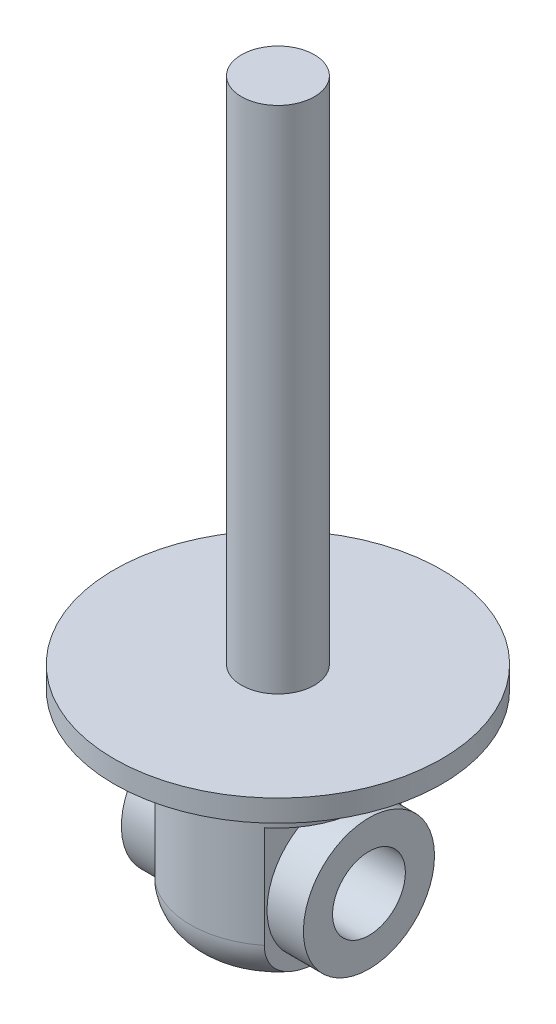
ISO-10303-21;
HEADER;
FILE_DESCRIPTION(('STEP AP214'),'2;1');
FILE_NAME('part.step','',(''),(''),'','','');
FILE_SCHEMA(('AUTOMOTIVE_DESIGN { 1 0 10303 214 1 1 1 1 }'));
ENDSEC;
DATA;
#1=APPLICATION_CONTEXT('core data for automotive mechanical design processes');
#2=APPLICATION_PROTOCOL_DEFINITION('international standard','automotive_design',2000,#1);
#3=PRODUCT_CONTEXT('',#1,'mechanical');
#4=PRODUCT('Part','Part','',(#3));
#5=PRODUCT_RELATED_PRODUCT_CATEGORY('part','',(#4));
#6=PRODUCT_DEFINITION_FORMATION('','',#4);
#7=PRODUCT_DEFINITION_CONTEXT('part definition',#1,'design');
#8=PRODUCT_DEFINITION('design','',#6,#7);
#9=PRODUCT_DEFINITION_SHAPE('','',#8);
#10=(LENGTH_UNIT() NAMED_UNIT(*) SI_UNIT(.MILLI.,.METRE.));
#11=(NAMED_UNIT(*) PLANE_ANGLE_UNIT() SI_UNIT($,.RADIAN.));
#12=(NAMED_UNIT(*) SI_UNIT($,.STERADIAN.) SOLID_ANGLE_UNIT());
#13=UNCERTAINTY_MEASURE_WITH_UNIT(LENGTH_MEASURE(1.E-05),#10,'distance_accuracy_value','');
#14=(GEOMETRIC_REPRESENTATION_CONTEXT(3) GLOBAL_UNCERTAINTY_ASSIGNED_CONTEXT((#13)) GLOBAL_UNIT_ASSIGNED_CONTEXT((#10,
#11,#12)) REPRESENTATION_CONTEXT('',''));
#15=CARTESIAN_POINT('',(0.,0.,0.));
#16=DIRECTION('',(0.,0.,1.));
#17=DIRECTION('',(1.,0.,0.));
#18=AXIS2_PLACEMENT_3D('',#15,#16,#17);
#19=CARTESIAN_POINT('',(-7.5,-8.,-14.));
#20=DIRECTION('',(1.,0.,0.));
#21=DIRECTION('',(0.,1.,0.));
#22=AXIS2_PLACEMENT_3D('',#19,#20,#21);
#23=PLANE('',#22);
#24=CARTESIAN_POINT('',(-7.5,-27.8094750193111,0.));
#25=CARTESIAN_POINT('',(-7.5,-27.8094752958151,0.184521628242419));
#26=CARTESIAN_POINT('',(-7.5,-27.8077270322999,0.369043480287191));
#27=CARTESIAN_POINT('',(-7.5,-27.8006130628877,0.737999394292284));
#28=CARTESIAN_POINT('',(-7.5,-27.7952477367066,0.922433463434384));
#29=CARTESIAN_POINT('',(-7.5,-27.780538513706,1.29122559425462));
#30=CARTESIAN_POINT('',(-7.5,-27.7711929215574,1.47558358999919));
#31=CARTESIAN_POINT('',(-7.5,-27.7479507640883,1.84401846668315));
#32=CARTESIAN_POINT('',(-7.5,-27.734054140347,2.02809534398339));
#33=CARTESIAN_POINT('',(-7.5,-27.701027325669,2.39498843631837));
#34=CARTESIAN_POINT('',(-7.5,-27.6819201299087,2.57780665418326));
#35=CARTESIAN_POINT('',(-7.5,-27.6375682217561,2.94269408038083));
#36=CARTESIAN_POINT('',(-7.5,-27.6123230495969,3.12476323156505));
#37=CARTESIAN_POINT('',(-7.5,-27.5259360262262,3.6691632505479));
#38=CARTESIAN_POINT('',(-7.5,-27.4541196223952,4.02997739530099));
#39=CARTESIAN_POINT('',(-7.5,-27.315114172541,4.57935988961709));
#40=CARTESIAN_POINT('',(-7.5,-27.2608348848703,4.77122256452969));
#41=CARTESIAN_POINT('',(-7.5,-27.1402411036094,5.15109529504942));
#42=CARTESIAN_POINT('',(-7.5,-27.0739312594077,5.33910680786539));
#43=CARTESIAN_POINT('',(-7.5,-26.928148698992,5.70992505463463));
#44=CARTESIAN_POINT('',(-7.5,-26.8486797977089,5.8927332791208));
#45=CARTESIAN_POINT('',(-7.5,-26.6756224712841,6.25155879665883));
#46=CARTESIAN_POINT('',(-7.5,-26.5820364486502,6.42757723883459));
#47=CARTESIAN_POINT('',(-7.5,-26.3958384208508,6.74413785402998));
#48=CARTESIAN_POINT('',(-7.5,-26.3053527427416,6.8859302136676));
#49=CARTESIAN_POINT('',(-7.5,-26.1136422044668,7.16205254122039));
#50=CARTESIAN_POINT('',(-7.5,-26.0124194056704,7.29638393401336));
#51=CARTESIAN_POINT('',(-7.5,-25.7991822855038,7.55627452274061));
#52=CARTESIAN_POINT('',(-7.5,-25.6871652583255,7.6818315054992));
#53=CARTESIAN_POINT('',(-7.5,-25.4525813942248,7.92270374400352));
#54=CARTESIAN_POINT('',(-7.5,-25.3300144777409,8.03801892249803));
#55=CARTESIAN_POINT('',(-7.5,-25.0736714823962,8.25792234562975));
#56=CARTESIAN_POINT('',(-7.5,-24.9398051473305,8.36240569865935));
#57=CARTESIAN_POINT('',(-7.5,-24.662616920615,8.55796576900282));
#58=CARTESIAN_POINT('',(-7.5,-24.5192963548439,8.64904436046083));
#59=CARTESIAN_POINT('',(-7.5,-24.2243409104845,8.81636481076627));
#60=CARTESIAN_POINT('',(-7.5,-24.0727112205185,8.89261579636783));
#61=CARTESIAN_POINT('',(-7.5,-23.7624095052739,9.02909243430965));
#62=CARTESIAN_POINT('',(-7.5,-23.6037388369551,9.08932115899453));
#63=CARTESIAN_POINT('',(-7.5,-23.3052245459151,9.1849514334904));
#64=CARTESIAN_POINT('',(-7.5,-23.1661361294911,9.22272405795733));
#65=CARTESIAN_POINT('',(-7.5,-22.8851087613884,9.28547940350164));
#66=CARTESIAN_POINT('',(-7.5,-22.7431701638949,9.31046370365637));
#67=CARTESIAN_POINT('',(-7.5,-22.4576599589478,9.34730641699016));
#68=CARTESIAN_POINT('',(-7.5,-22.3140890586128,9.35917031033292));
#69=CARTESIAN_POINT('',(-7.5,-22.0264648581988,9.36963164548865));
#70=CARTESIAN_POINT('',(-7.5,-21.8824115750842,9.36822954903948));
#71=CARTESIAN_POINT('',(-7.5,-21.6061914815275,9.35280339576898));
#72=CARTESIAN_POINT('',(-7.5,-21.4739684759154,9.33976569953801));
#73=CARTESIAN_POINT('',(-7.5,-21.2110534946456,9.3025636387872));
#74=CARTESIAN_POINT('',(-7.5,-21.0803620180608,9.27839574533066));
#75=CARTESIAN_POINT('',(-7.5,-20.8215410609612,9.21922065645586));
#76=CARTESIAN_POINT('',(-7.5,-20.6934101253726,9.18421981495561));
#77=CARTESIAN_POINT('',(-7.5,-20.4404340442512,9.1037455253616));
#78=CARTESIAN_POINT('',(-7.5,-20.3155901493276,9.05826815366643));
#79=CARTESIAN_POINT('',(-7.5,-20.0692031015505,8.95699564520569));
#80=CARTESIAN_POINT('',(-7.5,-19.9476868658852,8.90113499399756));
#81=CARTESIAN_POINT('',(-7.5,-19.7094920695403,8.77987692751897));
#82=CARTESIAN_POINT('',(-7.5,-19.5928152563103,8.71447610526943));
#83=CARTESIAN_POINT('',(-7.5,-19.2509911073174,8.50489875856372));
#84=CARTESIAN_POINT('',(-7.5,-19.0339195251877,8.34729299116935));
#85=CARTESIAN_POINT('',(-7.5,-18.609337427954,7.98870608163153));
#86=CARTESIAN_POINT('',(-7.5,-18.4039002281567,7.78529755950602));
#87=CARTESIAN_POINT('',(-7.5,-18.0246758733926,7.35109040646743));
#88=CARTESIAN_POINT('',(-7.5,-17.8508837047537,7.12029612399675));
#89=CARTESIAN_POINT('',(-7.5,-17.5744409595824,6.69864287979116));
#90=CARTESIAN_POINT('',(-7.5,-17.4648689537028,6.51223410047274));
#91=CARTESIAN_POINT('',(-7.5,-17.2626904112623,6.13034538679087));
#92=CARTESIAN_POINT('',(-7.5,-17.1700919878543,5.93486117014359));
#93=CARTESIAN_POINT('',(-7.5,-17.0006313082269,5.53658641063458));
#94=CARTESIAN_POINT('',(-7.5,-16.9238147555949,5.33377659321381));
#95=CARTESIAN_POINT('',(-7.5,-16.784875362625,4.92331428460811));
#96=CARTESIAN_POINT('',(-7.5,-16.7227484430634,4.71566315546475));
#97=CARTESIAN_POINT('',(-7.5,-16.5386673542946,4.02250667384637));
#98=CARTESIAN_POINT('',(-7.5,-16.4449803111871,3.52942656369883));
#99=CARTESIAN_POINT('',(-7.5,-16.3412352530644,2.78498720051468));
#100=CARTESIAN_POINT('',(-7.5,-16.3127705467372,2.53568557770051));
#101=CARTESIAN_POINT('',(-7.5,-16.2658269581612,2.03612434937441));
#102=CARTESIAN_POINT('',(-7.5,-16.2473468655649,1.78586486368144));
#103=CARTESIAN_POINT('',(-7.5,-16.2184283009414,1.28363112408655));
#104=CARTESIAN_POINT('',(-7.5,-16.208031590786,1.03165466176094));
#105=CARTESIAN_POINT('',(-7.5,-16.1941849220444,0.527501194688708));
#106=CARTESIAN_POINT('',(-7.5,-16.1907352988047,0.27532418084894));
#107=CARTESIAN_POINT('',(-7.5,-16.1903333462322,-0.228731345602946));
#108=CARTESIAN_POINT('',(-7.5,-16.193373232494,-0.480609853630143));
#109=CARTESIAN_POINT('',(-7.5,-16.2063332691715,-0.984173581494233));
#110=CARTESIAN_POINT('',(-7.5,-16.2162528039696,-1.2358588166087));
#111=CARTESIAN_POINT('',(-7.5,-16.2454935008677,-1.7627882566893));
#112=CARTESIAN_POINT('',(-7.5,-16.2656211327378,-2.03798990109168));
#113=CARTESIAN_POINT('',(-7.5,-16.3180418431017,-2.58731345976836));
#114=CARTESIAN_POINT('',(-7.5,-16.3503365349836,-2.86143522597441));
#115=CARTESIAN_POINT('',(-7.5,-16.4300545548583,-3.40623279358435));
#116=CARTESIAN_POINT('',(-7.5,-16.4774071358833,-3.67691867401872));
#117=CARTESIAN_POINT('',(-7.5,-16.5907053400646,-4.2143947607995));
#118=CARTESIAN_POINT('',(-7.5,-16.6566449229111,-4.4811862031647));
#119=CARTESIAN_POINT('',(-7.5,-16.7911834026755,-4.94217748017442));
#120=CARTESIAN_POINT('',(-7.5,-16.8549558474619,-5.13778160857807));
#121=CARTESIAN_POINT('',(-7.5,-16.9961265709521,-5.52399422741739));
#122=CARTESIAN_POINT('',(-7.5,-17.0735207892669,-5.71460418712136));
#123=CARTESIAN_POINT('',(-7.5,-17.2430793617625,-6.08921987221889));
#124=CARTESIAN_POINT('',(-7.5,-17.3352463319138,-6.27322442084438));
#125=CARTESIAN_POINT('',(-7.5,-17.5351759469553,-6.63256976145457));
#126=CARTESIAN_POINT('',(-7.5,-17.6429345063483,-6.80791280693597));
#127=CARTESIAN_POINT('',(-7.5,-17.8487615005736,-7.10989658300673));
#128=CARTESIAN_POINT('',(-7.5,-17.9436617626469,-7.23870103997639));
#129=CARTESIAN_POINT('',(-7.5,-18.143229826346,-7.48856622066219));
#130=CARTESIAN_POINT('',(-7.5,-18.2478987883735,-7.60962602152204));
#131=CARTESIAN_POINT('',(-7.5,-18.4668045949393,-7.84271387792474));
#132=CARTESIAN_POINT('',(-7.5,-18.5810384459287,-7.95474473789612));
#133=CARTESIAN_POINT('',(-7.5,-18.8187268203134,-8.16854933672494));
#134=CARTESIAN_POINT('',(-7.5,-18.9421800591116,-8.27032449994957));
#135=CARTESIAN_POINT('',(-7.5,-19.1987356397018,-8.46313596223061));
#136=CARTESIAN_POINT('',(-7.5,-19.3319055781875,-8.55408255407203));
#137=CARTESIAN_POINT('',(-7.5,-19.6061418402457,-8.72304401015934));
#138=CARTESIAN_POINT('',(-7.5,-19.747204378254,-8.80106500403696));
#139=CARTESIAN_POINT('',(-7.5,-20.0362068877473,-8.94309470867639));
#140=CARTESIAN_POINT('',(-7.5,-20.1841460034049,-9.00710515749598));
#141=CARTESIAN_POINT('',(-7.5,-20.4856380297523,-9.12014361193693));
#142=CARTESIAN_POINT('',(-7.5,-20.6391901444676,-9.16917373274798));
#143=CARTESIAN_POINT('',(-7.5,-20.9313639562727,-9.24643392787081));
#144=CARTESIAN_POINT('',(-7.5,-21.0695088202567,-9.27647685632879));
#145=CARTESIAN_POINT('',(-7.5,-21.3479315795213,-9.32406143536891));
#146=CARTESIAN_POINT('',(-7.5,-21.4882092809526,-9.34160421520928));
#147=CARTESIAN_POINT('',(-7.5,-21.769719609589,-9.36396002322678));
#148=CARTESIAN_POINT('',(-7.5,-21.9109518422674,-9.36877802253041));
#149=CARTESIAN_POINT('',(-7.5,-22.1932734390957,-9.36563613906261));
#150=CARTESIAN_POINT('',(-7.5,-22.3343628067459,-9.35767657732182));
#151=CARTESIAN_POINT('',(-7.5,-22.6064011749062,-9.32998563551062));
#152=CARTESIAN_POINT('',(-7.5,-22.7374295539783,-9.31102660205279));
#153=CARTESIAN_POINT('',(-7.5,-22.9974780227225,-9.26218788836622));
#154=CARTESIAN_POINT('',(-7.5,-23.1264974548056,-9.23230470755187));
#155=CARTESIAN_POINT('',(-7.5,-23.3815508516768,-9.16196479385525));
#156=CARTESIAN_POINT('',(-7.5,-23.5075862018083,-9.12151307666088));
#157=CARTESIAN_POINT('',(-7.5,-23.7559772755244,-9.03044888037393));
#158=CARTESIAN_POINT('',(-7.5,-23.8783315975104,-8.97983258590814));
#159=CARTESIAN_POINT('',(-7.5,-24.1205569584555,-8.8680617574251));
#160=CARTESIAN_POINT('',(-7.5,-24.2403549182387,-8.80674877020291));
#161=CARTESIAN_POINT('',(-7.5,-24.4747211723639,-8.67480187441993));
#162=CARTESIAN_POINT('',(-7.5,-24.5892875713423,-8.60416462323317));
#163=CARTESIAN_POINT('',(-7.5,-24.9242270275788,-8.37928997825773));
#164=CARTESIAN_POINT('',(-7.5,-25.13600210755,-8.21201407264852));
#165=CARTESIAN_POINT('',(-7.5,-25.5504485361803,-7.832942739178));
#166=CARTESIAN_POINT('',(-7.5,-25.7507010772538,-7.618532285847));
#167=CARTESIAN_POINT('',(-7.5,-26.1185076671662,-7.16337882817298));
#168=CARTESIAN_POINT('',(-7.5,-26.2860513710234,-6.9226275303298));
#169=CARTESIAN_POINT('',(-7.5,-26.5545024709803,-6.4788664395953));
#170=CARTESIAN_POINT('',(-7.5,-26.6619013252763,-6.279707295078));
#171=CARTESIAN_POINT('',(-7.5,-26.858559219587,-5.87254463104013));
#172=CARTESIAN_POINT('',(-7.5,-26.9478095430477,-5.66453691936401));
#173=CARTESIAN_POINT('',(-7.5,-27.1096214973705,-5.24180758530233));
#174=CARTESIAN_POINT('',(-7.5,-27.1821555960046,-5.02707553901332));
#175=CARTESIAN_POINT('',(-7.5,-27.3121001369762,-4.59305326757356));
#176=CARTESIAN_POINT('',(-7.5,-27.3695048137837,-4.37376133898657));
#177=CARTESIAN_POINT('',(-7.5,-27.4981886749365,-3.81417726059937));
#178=CARTESIAN_POINT('',(-7.5,-27.5604951716191,-3.4718329690517));
#179=CARTESIAN_POINT('',(-7.5,-27.6609019684328,-2.7835920061487));
#180=CARTESIAN_POINT('',(-7.5,-27.6989863972919,-2.43769315620305));
#181=CARTESIAN_POINT('',(-7.5,-27.7425563308733,-1.91723181279188));
#182=CARTESIAN_POINT('',(-7.5,-27.7548291128016,-1.74318957751326));
#183=CARTESIAN_POINT('',(-7.5,-27.7753986995787,-1.39487161182967));
#184=CARTESIAN_POINT('',(-7.5,-27.7836956019396,-1.22059588725638));
#185=CARTESIAN_POINT('',(-7.5,-27.796777523185,-0.87196539298604));
#186=CARTESIAN_POINT('',(-7.5,-27.8015635129394,-0.697610658492171));
#187=CARTESIAN_POINT('',(-7.5,-27.8079121855994,-0.348837350643893));
#188=CARTESIAN_POINT('',(-7.5,-27.8094747579462,-0.174418775305038));
#189=CARTESIAN_POINT('',(-7.5,-27.8094750193111,0.));
#190=B_SPLINE_CURVE_WITH_KNOTS('',3,(#24,#25,#26,#27,#28,#29,#30,#31,#32,#33,#34,#35,#36,#37,
#38,#39,#40,#41,#42,#43,#44,#45,#46,#47,#48,#49,#50,#51,#52,#53,#54,#55,#56,#57,#58,#59,#60,#61,
#62,#63,#64,#65,#66,#67,#68,#69,#70,#71,#72,#73,#74,#75,#76,#77,#78,#79,#80,#81,#82,#83,#84,#85,
#86,#87,#88,#89,#90,#91,#92,#93,#94,#95,#96,#97,#98,#99,#100,#101,#102,#103,#104,#105,#106,#107,
#108,#109,#110,#111,#112,#113,#114,#115,#116,#117,#118,#119,#120,#121,#122,#123,#124,#125,#126,
#127,#128,#129,#130,#131,#132,#133,#134,#135,#136,#137,#138,#139,#140,#141,#142,#143,#144,#145,
#146,#147,#148,#149,#150,#151,#152,#153,#154,#155,#156,#157,#158,#159,#160,#161,#162,#163,#164,
#165,#166,#167,#168,#169,#170,#171,#172,#173,#174,#175,#176,#177,#178,#179,#180,#181,#182,#183,
#184,#185,#186,#187,#188,#189),.UNSPECIFIED.,.T.,.F.,(4,2,2,2,2,2,2,2,2,2,2,2,2,2,2,2,2,2,2,2,2,
2,2,2,2,2,2,2,2,2,2,2,2,2,2,2,2,2,2,2,2,2,2,2,2,2,2,2,2,2,2,2,2,2,2,2,2,2,2,2,2,2,2,2,2,2,2,2,2,
2,2,2,2,2,2,2,2,2,2,2,2,2,4),(0.,0.553556541747907,1.10705498067111,1.6607894093517,
2.21453094651203,2.76586720349669,3.31724477121585,4.41912680182766,5.01698525599297,
5.61461314908642,6.21206808675634,6.80942146164093,7.31357153503217,7.81762499361292,
8.32180513447661,8.82598907791493,9.33467160980088,9.84328295415676,10.3515802378956,
10.8597799828438,11.291588037567,11.7233427606026,12.1549170790764,12.5864763761706,
12.9845986570771,13.3828472534997,13.7808627038906,14.1790274594521,14.579795450788,
14.9807069160888,15.7821103743006,16.6461503316802,17.5100532757815,18.1578732554314,
18.8060020817716,19.4559821948788,20.1057815998326,21.6069748462105,22.3596793389022,
23.1122925673175,23.8687687149109,24.6252813779039,25.3808870860738,26.1364251884592,
26.9640249034877,27.7917343993232,28.6156111127982,29.4392203950451,30.0559954213971,
30.6725869093732,31.2892877047367,31.9058271963482,32.3853559200308,32.8649416785199,
33.3443778968313,33.823747436381,34.3068464150843,34.7897156366604,35.2725249226045,
35.7552660053908,36.1788379642465,36.6023716529343,37.0257398573389,37.4490974249689,
37.8458122806135,38.2426543730445,38.639308470493,39.0361117351622,39.4393886143668,
39.8428104576492,40.6491243408277,41.5260051520067,42.403162850804,43.0810551134699,
43.7592721958252,44.4385984678267,45.1181832448308,46.1608437011148,47.2041866484774,
47.7275747628343,48.2509500399341,48.7741805338585,49.2974289735857),.UNSPECIFIED.);
#191=CARTESIAN_POINT('',(-7.5,-22.,-9.3674969975976));
#192=VERTEX_POINT('',#191);
#193=CARTESIAN_POINT('',(-7.5,-21.9999999999999,9.36749699759766));
#194=VERTEX_POINT('',#193);
#195=EDGE_CURVE('E144',#192,#194,#190,.T.);
#196=ORIENTED_EDGE('',*,*,#195,.T.);
#197=DIRECTION('',(0.,1.,0.));
#198=VECTOR('',#197,1.);
#199=CARTESIAN_POINT('',(-7.5,-28.,9.3674969975976));
#200=LINE('',#199,#198);
#201=CARTESIAN_POINT('',(-7.5,-8.,9.3674969975976));
#202=VERTEX_POINT('',#201);
#203=EDGE_CURVE('E95',#202,#194,#200,.F.);
#204=ORIENTED_EDGE('',*,*,#203,.F.);
#205=DIRECTION('',(0.,0.,1.));
#206=VECTOR('',#205,1.);
#207=CARTESIAN_POINT('',(-7.5,-8.,-14.));
#208=LINE('',#207,#206);
#209=CARTESIAN_POINT('',(-7.5,-8.,-9.3674969975976));
#210=VERTEX_POINT('',#209);
#211=EDGE_CURVE('E87',#210,#202,#208,.T.);
#212=ORIENTED_EDGE('',*,*,#211,.F.);
#213=DIRECTION('',(0.,1.,0.));
#214=VECTOR('',#213,1.);
#215=CARTESIAN_POINT('',(-7.5,-28.,-9.3674969975976));
#216=LINE('',#215,#214);
#217=EDGE_CURVE('E65',#192,#210,#216,.T.);
#218=ORIENTED_EDGE('',*,*,#217,.F.);
#219=EDGE_LOOP('',(#196,#204,#212,#218));
#220=FACE_BOUND('',#219,.T.);
#221=CARTESIAN_POINT('',(-7.5,-18.,0.));
#222=DIRECTION('',(1.,0.,0.));
#223=DIRECTION('',(0.,1.,0.));
#224=AXIS2_PLACEMENT_3D('',#221,#222,#223);
#225=CIRCLE('',#224,9.);
#226=CARTESIAN_POINT('',(-7.5,-9.,0.));
#227=VERTEX_POINT('',#226);
#228=EDGE_CURVE('E11',#227,#227,#225,.F.);
#229=ORIENTED_EDGE('',*,*,#228,.F.);
#230=EDGE_LOOP('',(#229));
#231=FACE_BOUND('',#230,.T.);
#232=ADVANCED_FACE('F39',(#220,#231),#23,.F.);
#233=CARTESIAN_POINT('',(7.5,-8.,-14.));
#234=DIRECTION('',(-1.,0.,0.));
#235=DIRECTION('',(0.,-1.,0.));
#236=AXIS2_PLACEMENT_3D('',#233,#234,#235);
#237=PLANE('',#236);
#238=CARTESIAN_POINT('',(7.5,-27.8094750193111,0.));
#239=CARTESIAN_POINT('',(7.5,-27.8094752958151,-0.18452162824242));
#240=CARTESIAN_POINT('',(7.5,-27.8077270322999,-0.369043480287192));
#241=CARTESIAN_POINT('',(7.5,-27.8006130628877,-0.737999394292286));
#242=CARTESIAN_POINT('',(7.5,-27.7952477367066,-0.922433463434386));
#243=CARTESIAN_POINT('',(7.5,-27.780538513706,-1.29122559425462));
#244=CARTESIAN_POINT('',(7.5,-27.7711929215574,-1.47558358999919));
#245=CARTESIAN_POINT('',(7.5,-27.7479507640883,-1.84401846668315));
#246=CARTESIAN_POINT('',(7.5,-27.734054140347,-2.0280953439834));
#247=CARTESIAN_POINT('',(7.5,-27.701027325669,-2.39498843631837));
#248=CARTESIAN_POINT('',(7.5,-27.6819201299087,-2.57780665418327));
#249=CARTESIAN_POINT('',(7.5,-27.6375682217561,-2.94269408038084));
#250=CARTESIAN_POINT('',(7.5,-27.6123230495969,-3.12476323156505));
#251=CARTESIAN_POINT('',(7.5,-27.5259360262262,-3.6691632505479));
#252=CARTESIAN_POINT('',(7.5,-27.4541196223952,-4.029977395301));
#253=CARTESIAN_POINT('',(7.5,-27.315114172541,-4.57935988961709));
#254=CARTESIAN_POINT('',(7.5,-27.2608348848703,-4.7712225645297));
#255=CARTESIAN_POINT('',(7.5,-27.1402411036094,-5.15109529504943));
#256=CARTESIAN_POINT('',(7.5,-27.0739312594077,-5.3391068078654));
#257=CARTESIAN_POINT('',(7.5,-26.9281486989919,-5.70992505463464));
#258=CARTESIAN_POINT('',(7.5,-26.8486797977089,-5.8927332791208));
#259=CARTESIAN_POINT('',(7.5,-26.6756224712841,-6.25155879665883));
#260=CARTESIAN_POINT('',(7.5,-26.5820364486501,-6.4275772388346));
#261=CARTESIAN_POINT('',(7.5,-26.3958384208508,-6.74413785402998));
#262=CARTESIAN_POINT('',(7.5,-26.3053527427416,-6.8859302136676));
#263=CARTESIAN_POINT('',(7.5,-26.1136422044668,-7.16205254122039));
#264=CARTESIAN_POINT('',(7.5,-26.0124194056704,-7.29638393401336));
#265=CARTESIAN_POINT('',(7.5,-25.7991822855038,-7.55627452274061));
#266=CARTESIAN_POINT('',(7.5,-25.6871652583255,-7.6818315054992));
#267=CARTESIAN_POINT('',(7.5,-25.4525813942248,-7.92270374400352));
#268=CARTESIAN_POINT('',(7.5,-25.3300144777409,-8.03801892249802));
#269=CARTESIAN_POINT('',(7.5,-25.0736714823962,-8.25792234562975));
#270=CARTESIAN_POINT('',(7.5,-24.9398051473305,-8.36240569865935));
#271=CARTESIAN_POINT('',(7.5,-24.662616920615,-8.55796576900281));
#272=CARTESIAN_POINT('',(7.5,-24.5192963548439,-8.64904436046082));
#273=CARTESIAN_POINT('',(7.5,-24.2243409104845,-8.81636481076626));
#274=CARTESIAN_POINT('',(7.5,-24.0727112205184,-8.89261579636783));
#275=CARTESIAN_POINT('',(7.5,-23.7624095052739,-9.02909243430965));
#276=CARTESIAN_POINT('',(7.5,-23.6037388369551,-9.08932115899453));
#277=CARTESIAN_POINT('',(7.5,-23.3052245459151,-9.1849514334904));
#278=CARTESIAN_POINT('',(7.5,-23.1661361294911,-9.22272405795733));
#279=CARTESIAN_POINT('',(7.5,-22.8851087613884,-9.28547940350163));
#280=CARTESIAN_POINT('',(7.5,-22.7431701638949,-9.31046370365637));
#281=CARTESIAN_POINT('',(7.5,-22.4576599589478,-9.34730641699015));
#282=CARTESIAN_POINT('',(7.5,-22.3140890586128,-9.35917031033292));
#283=CARTESIAN_POINT('',(7.5,-22.0264648581988,-9.36963164548865));
#284=CARTESIAN_POINT('',(7.5,-21.8824115750842,-9.36822954903947));
#285=CARTESIAN_POINT('',(7.5,-21.6061914815275,-9.35280339576898));
#286=CARTESIAN_POINT('',(7.5,-21.4739684759153,-9.33976569953801));
#287=CARTESIAN_POINT('',(7.5,-21.2110534946456,-9.3025636387872));
#288=CARTESIAN_POINT('',(7.5,-21.0803620180608,-9.27839574533065));
#289=CARTESIAN_POINT('',(7.5,-20.8215410609612,-9.21922065645586));
#290=CARTESIAN_POINT('',(7.5,-20.6934101253726,-9.1842198149556));
#291=CARTESIAN_POINT('',(7.5,-20.4404340442512,-9.1037455253616));
#292=CARTESIAN_POINT('',(7.5,-20.3155901493276,-9.05826815366643));
#293=CARTESIAN_POINT('',(7.5,-20.0692031015505,-8.95699564520569));
#294=CARTESIAN_POINT('',(7.5,-19.9476868658852,-8.90113499399755));
#295=CARTESIAN_POINT('',(7.5,-19.7094920695403,-8.77987692751896));
#296=CARTESIAN_POINT('',(7.5,-19.5928152563103,-8.71447610526943));
#297=CARTESIAN_POINT('',(7.5,-19.2509911073174,-8.50489875856371));
#298=CARTESIAN_POINT('',(7.5,-19.0339195251877,-8.34729299116934));
#299=CARTESIAN_POINT('',(7.5,-18.609337427954,-7.98870608163152));
#300=CARTESIAN_POINT('',(7.5,-18.4039002281567,-7.78529755950601));
#301=CARTESIAN_POINT('',(7.5,-18.0246758733926,-7.35109040646742));
#302=CARTESIAN_POINT('',(7.5,-17.8508837047537,-7.12029612399674));
#303=CARTESIAN_POINT('',(7.5,-17.5744409595824,-6.69864287979115));
#304=CARTESIAN_POINT('',(7.5,-17.4648689537028,-6.51223410047273));
#305=CARTESIAN_POINT('',(7.5,-17.2626904112623,-6.13034538679086));
#306=CARTESIAN_POINT('',(7.5,-17.1700919878543,-5.93486117014358));
#307=CARTESIAN_POINT('',(7.5,-17.0006313082269,-5.53658641063457));
#308=CARTESIAN_POINT('',(7.5,-16.9238147555949,-5.3337765932138));
#309=CARTESIAN_POINT('',(7.5,-16.784875362625,-4.9233142846081));
#310=CARTESIAN_POINT('',(7.5,-16.7227484430634,-4.71566315546474));
#311=CARTESIAN_POINT('',(7.5,-16.5386673542946,-4.02250667384636));
#312=CARTESIAN_POINT('',(7.5,-16.4449803111871,-3.52942656369882));
#313=CARTESIAN_POINT('',(7.5,-16.3412352530644,-2.78498720051467));
#314=CARTESIAN_POINT('',(7.5,-16.3127705467372,-2.53568557770051));
#315=CARTESIAN_POINT('',(7.5,-16.2658269581612,-2.0361243493744));
#316=CARTESIAN_POINT('',(7.5,-16.2473468655649,-1.78586486368143));
#317=CARTESIAN_POINT('',(7.5,-16.2184283009414,-1.28363112408654));
#318=CARTESIAN_POINT('',(7.5,-16.208031590786,-1.03165466176093));
#319=CARTESIAN_POINT('',(7.5,-16.1941849220444,-0.5275011946887));
#320=CARTESIAN_POINT('',(7.5,-16.1907352988047,-0.275324180848932));
#321=CARTESIAN_POINT('',(7.5,-16.1903333462322,0.228731345602954));
#322=CARTESIAN_POINT('',(7.5,-16.193373232494,0.480609853630152));
#323=CARTESIAN_POINT('',(7.5,-16.2063332691715,0.984173581494243));
#324=CARTESIAN_POINT('',(7.5,-16.2162528039696,1.23585881660871));
#325=CARTESIAN_POINT('',(7.5,-16.2454935008677,1.76278825668931));
#326=CARTESIAN_POINT('',(7.5,-16.2656211327378,2.03798990109169));
#327=CARTESIAN_POINT('',(7.5,-16.3180418431018,2.58731345976837));
#328=CARTESIAN_POINT('',(7.5,-16.3503365349836,2.86143522597442));
#329=CARTESIAN_POINT('',(7.5,-16.4300545548583,3.40623279358436));
#330=CARTESIAN_POINT('',(7.5,-16.4774071358833,3.67691867401872));
#331=CARTESIAN_POINT('',(7.5,-16.5907053400646,4.21439476079951));
#332=CARTESIAN_POINT('',(7.5,-16.6566449229111,4.48118620316469));
#333=CARTESIAN_POINT('',(7.5,-16.7911834026755,4.94217748017442));
#334=CARTESIAN_POINT('',(7.5,-16.8549558474619,5.13778160857807));
#335=CARTESIAN_POINT('',(7.5,-16.9961265709521,5.52399422741739));
#336=CARTESIAN_POINT('',(7.5,-17.0735207892669,5.71460418712136));
#337=CARTESIAN_POINT('',(7.5,-17.2430793617625,6.08921987221889));
#338=CARTESIAN_POINT('',(7.5,-17.3352463319138,6.27322442084438));
#339=CARTESIAN_POINT('',(7.5,-17.5351759469553,6.63256976145457));
#340=CARTESIAN_POINT('',(7.5,-17.6429345063483,6.80791280693597));
#341=CARTESIAN_POINT('',(7.5,-17.8487615005736,7.10989658300673));
#342=CARTESIAN_POINT('',(7.5,-17.9436617626469,7.23870103997639));
#343=CARTESIAN_POINT('',(7.5,-18.143229826346,7.48856622066219));
#344=CARTESIAN_POINT('',(7.5,-18.2478987883735,7.60962602152205));
#345=CARTESIAN_POINT('',(7.5,-18.4668045949393,7.84271387792474));
#346=CARTESIAN_POINT('',(7.5,-18.5810384459287,7.95474473789612));
#347=CARTESIAN_POINT('',(7.5,-18.8187268203134,8.16854933672494));
#348=CARTESIAN_POINT('',(7.5,-18.9421800591116,8.27032449994956));
#349=CARTESIAN_POINT('',(7.5,-19.1987356397018,8.46313596223061));
#350=CARTESIAN_POINT('',(7.5,-19.3319055781875,8.55408255407202));
#351=CARTESIAN_POINT('',(7.5,-19.6061418402457,8.72304401015933));
#352=CARTESIAN_POINT('',(7.5,-19.747204378254,8.80106500403696));
#353=CARTESIAN_POINT('',(7.5,-20.0362068877473,8.94309470867638));
#354=CARTESIAN_POINT('',(7.5,-20.1841460034049,9.00710515749598));
#355=CARTESIAN_POINT('',(7.5,-20.4856380297523,9.12014361193692));
#356=CARTESIAN_POINT('',(7.5,-20.6391901444676,9.16917373274798));
#357=CARTESIAN_POINT('',(7.5,-20.9313639562727,9.24643392787081));
#358=CARTESIAN_POINT('',(7.5,-21.0695088202567,9.27647685632879));
#359=CARTESIAN_POINT('',(7.5,-21.3479315795213,9.32406143536891));
#360=CARTESIAN_POINT('',(7.5,-21.4882092809526,9.34160421520928));
#361=CARTESIAN_POINT('',(7.5,-21.769719609589,9.36396002322678));
#362=CARTESIAN_POINT('',(7.5,-21.9109518422674,9.36877802253041));
#363=CARTESIAN_POINT('',(7.5,-22.1932734390957,9.3656361390626));
#364=CARTESIAN_POINT('',(7.5,-22.3343628067459,9.35767657732181));
#365=CARTESIAN_POINT('',(7.5,-22.6064011749062,9.32998563551062));
#366=CARTESIAN_POINT('',(7.5,-22.7374295539783,9.31102660205278));
#367=CARTESIAN_POINT('',(7.5,-22.9974780227225,9.26218788836621));
#368=CARTESIAN_POINT('',(7.5,-23.1264974548056,9.23230470755187));
#369=CARTESIAN_POINT('',(7.5,-23.3815508516768,9.16196479385525));
#370=CARTESIAN_POINT('',(7.5,-23.5075862018084,9.12151307666088));
#371=CARTESIAN_POINT('',(7.5,-23.7559772755244,9.03044888037393));
#372=CARTESIAN_POINT('',(7.5,-23.8783315975104,8.97983258590813));
#373=CARTESIAN_POINT('',(7.5,-24.1205569584555,8.86806175742509));
#374=CARTESIAN_POINT('',(7.5,-24.2403549182387,8.8067487702029));
#375=CARTESIAN_POINT('',(7.5,-24.4747211723639,8.67480187441993));
#376=CARTESIAN_POINT('',(7.5,-24.5892875713423,8.60416462323317));
#377=CARTESIAN_POINT('',(7.5,-24.9242270275788,8.37928997825773));
#378=CARTESIAN_POINT('',(7.5,-25.13600210755,8.21201407264852));
#379=CARTESIAN_POINT('',(7.5,-25.5504485361803,7.832942739178));
#380=CARTESIAN_POINT('',(7.5,-25.7507010772538,7.61853228584699));
#381=CARTESIAN_POINT('',(7.5,-26.1185076671662,7.16337882817298));
#382=CARTESIAN_POINT('',(7.5,-26.2860513710234,6.92262753032979));
#383=CARTESIAN_POINT('',(7.5,-26.5545024709803,6.4788664395953));
#384=CARTESIAN_POINT('',(7.5,-26.6619013252763,6.27970729507799));
#385=CARTESIAN_POINT('',(7.5,-26.858559219587,5.87254463104013));
#386=CARTESIAN_POINT('',(7.5,-26.9478095430477,5.66453691936401));
#387=CARTESIAN_POINT('',(7.5,-27.1096214973705,5.24180758530233));
#388=CARTESIAN_POINT('',(7.5,-27.1821555960046,5.02707553901331));
#389=CARTESIAN_POINT('',(7.5,-27.3121001369762,4.59305326757356));
#390=CARTESIAN_POINT('',(7.5,-27.3695048137837,4.37376133898656));
#391=CARTESIAN_POINT('',(7.5,-27.4981886749365,3.81417726059937));
#392=CARTESIAN_POINT('',(7.5,-27.5604951716191,3.4718329690517));
#393=CARTESIAN_POINT('',(7.5,-27.6609019684328,2.78359200614869));
#394=CARTESIAN_POINT('',(7.5,-27.6989863972919,2.43769315620305));
#395=CARTESIAN_POINT('',(7.5,-27.7425563308733,1.91723181279188));
#396=CARTESIAN_POINT('',(7.5,-27.7548291128016,1.74318957751326));
#397=CARTESIAN_POINT('',(7.5,-27.7753986995787,1.39487161182967));
#398=CARTESIAN_POINT('',(7.5,-27.7836956019396,1.22059588725638));
#399=CARTESIAN_POINT('',(7.5,-27.796777523185,0.87196539298604));
#400=CARTESIAN_POINT('',(7.5,-27.8015635129394,0.697610658492171));
#401=CARTESIAN_POINT('',(7.5,-27.8079121855994,0.348837350643893));
#402=CARTESIAN_POINT('',(7.5,-27.8094747579462,0.174418775305038));
#403=CARTESIAN_POINT('',(7.5,-27.8094750193111,0.));
#404=B_SPLINE_CURVE_WITH_KNOTS('',3,(#238,#239,#240,#241,#242,#243,#244,#245,#246,#247,#248,
#249,#250,#251,#252,#253,#254,#255,#256,#257,#258,#259,#260,#261,#262,#263,#264,#265,#266,#267,
#268,#269,#270,#271,#272,#273,#274,#275,#276,#277,#278,#279,#280,#281,#282,#283,#284,#285,#286,
#287,#288,#289,#290,#291,#292,#293,#294,#295,#296,#297,#298,#299,#300,#301,#302,#303,#304,#305,
#306,#307,#308,#309,#310,#311,#312,#313,#314,#315,#316,#317,#318,#319,#320,#321,#322,#323,#324,
#325,#326,#327,#328,#329,#330,#331,#332,#333,#334,#335,#336,#337,#338,#339,#340,#341,#342,#343,
#344,#345,#346,#347,#348,#349,#350,#351,#352,#353,#354,#355,#356,#357,#358,#359,#360,#361,#362,
#363,#364,#365,#366,#367,#368,#369,#370,#371,#372,#373,#374,#375,#376,#377,#378,#379,#380,#381,
#382,#383,#384,#385,#386,#387,#388,#389,#390,#391,#392,#393,#394,#395,#396,#397,#398,#399,#400,
#401,#402,#403),.UNSPECIFIED.,.T.,.F.,(4,2,2,2,2,2,2,2,2,2,2,2,2,2,2,2,2,2,2,2,2,2,2,2,2,2,2,2,
2,2,2,2,2,2,2,2,2,2,2,2,2,2,2,2,2,2,2,2,2,2,2,2,2,2,2,2,2,2,2,2,2,2,2,2,2,2,2,2,2,2,2,2,2,2,2,2,
2,2,2,2,2,2,4),(0.,0.553556541747909,1.10705498067111,1.66078940935171,2.21453094651203,
2.7658672034967,3.31724477121586,4.41912680182767,5.01698525599298,5.61461314908642,
6.21206808675635,6.80942146164093,7.31357153503217,7.81762499361292,8.32180513447662,
8.82598907791493,9.33467160980088,9.84328295415676,10.3515802378956,10.8597799828438,
11.291588037567,11.7233427606026,12.1549170790764,12.5864763761706,12.9845986570771,
13.3828472534997,13.7808627038906,14.1790274594521,14.579795450788,14.9807069160888,
15.7821103743006,16.6461503316802,17.5100532757815,18.1578732554314,18.8060020817716,
19.4559821948788,20.1057815998326,21.6069748462105,22.3596793389022,23.1122925673175,
23.8687687149109,24.6252813779039,25.3808870860738,26.1364251884592,26.9640249034877,
27.7917343993232,28.6156111127982,29.4392203950451,30.0559954213971,30.6725869093732,
31.2892877047367,31.9058271963482,32.3853559200308,32.8649416785199,33.3443778968313,
33.823747436381,34.3068464150843,34.7897156366603,35.2725249226045,35.7552660053908,
36.1788379642464,36.6023716529342,37.0257398573389,37.4490974249688,37.8458122806135,
38.2426543730445,38.6393084704929,39.0361117351622,39.4393886143667,39.8428104576491,
40.6491243408276,41.5260051520067,42.4031628508039,43.0810551134699,43.7592721958252,
44.4385984678267,45.1181832448308,46.1608437011148,47.2041866484774,47.7275747628343,
48.2509500399341,48.7741805338585,49.2974289735857),.UNSPECIFIED.);
#405=CARTESIAN_POINT('',(7.5,-22.,9.3674969975976));
#406=VERTEX_POINT('',#405);
#407=CARTESIAN_POINT('',(7.5,-21.9999999999999,-9.36749699759765));
#408=VERTEX_POINT('',#407);
#409=EDGE_CURVE('E92',#406,#408,#404,.T.);
#410=ORIENTED_EDGE('',*,*,#409,.T.);
#411=DIRECTION('',(0.,1.,0.));
#412=VECTOR('',#411,1.);
#413=CARTESIAN_POINT('',(7.5,-28.,-9.3674969975976));
#414=LINE('',#413,#412);
#415=CARTESIAN_POINT('',(7.5,-8.,-9.3674969975976));
#416=VERTEX_POINT('',#415);
#417=EDGE_CURVE('E108',#416,#408,#414,.F.);
#418=ORIENTED_EDGE('',*,*,#417,.F.);
#419=DIRECTION('',(0.,0.,1.));
#420=VECTOR('',#419,1.);
#421=CARTESIAN_POINT('',(7.5,-8.,-14.));
#422=LINE('',#421,#420);
#423=CARTESIAN_POINT('',(7.5,-8.,9.3674969975976));
#424=VERTEX_POINT('',#423);
#425=EDGE_CURVE('E97',#416,#424,#422,.T.);
#426=ORIENTED_EDGE('',*,*,#425,.T.);
#427=DIRECTION('',(0.,1.,0.));
#428=VECTOR('',#427,1.);
#429=CARTESIAN_POINT('',(7.5,-28.,9.3674969975976));
#430=LINE('',#429,#428);
#431=EDGE_CURVE('E57',#406,#424,#430,.T.);
#432=ORIENTED_EDGE('',*,*,#431,.F.);
#433=EDGE_LOOP('',(#410,#418,#426,#432));
#434=FACE_BOUND('',#433,.T.);
#435=CARTESIAN_POINT('',(7.5,-18.,0.));
#436=DIRECTION('',(-1.,0.,0.));
#437=DIRECTION('',(0.,-1.,0.));
#438=AXIS2_PLACEMENT_3D('',#435,#436,#437);
#439=CIRCLE('',#438,9.);
#440=CARTESIAN_POINT('',(7.5,-27.,0.));
#441=VERTEX_POINT('',#440);
#442=EDGE_CURVE('E44',#441,#441,#439,.F.);
#443=ORIENTED_EDGE('',*,*,#442,.F.);
#444=EDGE_LOOP('',(#443));
#445=FACE_BOUND('',#444,.T.);
#446=ADVANCED_FACE('F159',(#434,#445),#237,.F.);
#447=CARTESIAN_POINT('',(0.,3.,0.));
#448=DIRECTION('',(0.,-1.,0.));
#449=DIRECTION('',(0.,0.,-1.));
#450=AXIS2_PLACEMENT_3D('',#447,#448,#449);
#451=CYLINDRICAL_SURFACE('',#450,22.5);
#452=CARTESIAN_POINT('',(0.,3.,0.));
#453=DIRECTION('',(0.,1.,0.));
#454=DIRECTION('',(0.,0.,1.));
#455=AXIS2_PLACEMENT_3D('',#452,#453,#454);
#456=CIRCLE('',#455,22.5);
#457=CARTESIAN_POINT('',(0.,3.,22.5));
#458=VERTEX_POINT('',#457);
#459=EDGE_CURVE('E131',#458,#458,#456,.T.);
#460=ORIENTED_EDGE('',*,*,#459,.F.);
#461=EDGE_LOOP('',(#460));
#462=FACE_BOUND('',#461,.T.);
#463=CARTESIAN_POINT('',(0.,0.,0.));
#464=DIRECTION('',(0.,1.,0.));
#465=DIRECTION('',(0.,0.,1.));
#466=AXIS2_PLACEMENT_3D('',#463,#464,#465);
#467=CIRCLE('',#466,22.5);
#468=CARTESIAN_POINT('',(0.,0.,22.5));
#469=VERTEX_POINT('',#468);
#470=EDGE_CURVE('E127',#469,#469,#467,.T.);
#471=ORIENTED_EDGE('',*,*,#470,.T.);
#472=EDGE_LOOP('',(#471));
#473=FACE_BOUND('',#472,.T.);
#474=ADVANCED_FACE('F181',(#462,#473),#451,.T.);
#475=CARTESIAN_POINT('',(0.,3.,0.));
#476=DIRECTION('',(0.,1.,0.));
#477=DIRECTION('',(0.,0.,1.));
#478=AXIS2_PLACEMENT_3D('',#475,#476,#477);
#479=PLANE('',#478);
#480=CARTESIAN_POINT('',(0.,3.,0.));
#481=DIRECTION('',(0.,1.,0.));
#482=DIRECTION('',(0.,0.,1.));
#483=AXIS2_PLACEMENT_3D('',#480,#481,#482);
#484=CIRCLE('',#483,5.);
#485=CARTESIAN_POINT('',(0.,3.,5.));
#486=VERTEX_POINT('',#485);
#487=EDGE_CURVE('E123',#486,#486,#484,.T.);
#488=ORIENTED_EDGE('',*,*,#487,.F.);
#489=EDGE_LOOP('',(#488));
#490=FACE_BOUND('',#489,.T.);
#491=ORIENTED_EDGE('',*,*,#459,.T.);
#492=EDGE_LOOP('',(#491));
#493=FACE_BOUND('',#492,.T.);
#494=ADVANCED_FACE('F178',(#490,#493),#479,.T.);
#495=CARTESIAN_POINT('',(0.,0.,0.));
#496=DIRECTION('',(0.,1.,0.));
#497=DIRECTION('',(0.,0.,1.));
#498=AXIS2_PLACEMENT_3D('',#495,#496,#497);
#499=PLANE('',#498);
#500=CARTESIAN_POINT('',(0.,0.,0.));
#501=DIRECTION('',(0.,-1.,0.));
#502=DIRECTION('',(0.,0.,-1.));
#503=AXIS2_PLACEMENT_3D('',#500,#501,#502);
#504=CIRCLE('',#503,12.);
#505=CARTESIAN_POINT('',(0.,0.,-12.));
#506=VERTEX_POINT('',#505);
#507=EDGE_CURVE('E118',#506,#506,#504,.T.);
#508=ORIENTED_EDGE('',*,*,#507,.F.);
#509=EDGE_LOOP('',(#508));
#510=FACE_BOUND('',#509,.T.);
#511=ORIENTED_EDGE('',*,*,#470,.F.);
#512=EDGE_LOOP('',(#511));
#513=FACE_BOUND('',#512,.T.);
#514=ADVANCED_FACE('F176',(#510,#513),#499,.F.);
#515=CARTESIAN_POINT('',(0.,73.,0.));
#516=DIRECTION('',(0.,-1.,0.));
#517=DIRECTION('',(0.,0.,-1.));
#518=AXIS2_PLACEMENT_3D('',#515,#516,#517);
#519=CYLINDRICAL_SURFACE('',#518,5.);
#520=CARTESIAN_POINT('',(0.,73.,0.));
#521=DIRECTION('',(0.,1.,0.));
#522=DIRECTION('',(0.,0.,1.));
#523=AXIS2_PLACEMENT_3D('',#520,#521,#522);
#524=CIRCLE('',#523,5.);
#525=CARTESIAN_POINT('',(0.,73.,5.));
#526=VERTEX_POINT('',#525);
#527=EDGE_CURVE('E117',#526,#526,#524,.T.);
#528=ORIENTED_EDGE('',*,*,#527,.F.);
#529=EDGE_LOOP('',(#528));
#530=FACE_BOUND('',#529,.T.);
#531=ORIENTED_EDGE('',*,*,#487,.T.);
#532=EDGE_LOOP('',(#531));
#533=FACE_BOUND('',#532,.T.);
#534=ADVANCED_FACE('F172',(#530,#533),#519,.T.);
#535=CARTESIAN_POINT('',(0.,73.,0.));
#536=DIRECTION('',(0.,1.,0.));
#537=DIRECTION('',(0.,0.,1.));
#538=AXIS2_PLACEMENT_3D('',#535,#536,#537);
#539=PLANE('',#538);
#540=ORIENTED_EDGE('',*,*,#527,.T.);
#541=EDGE_LOOP('',(#540));
#542=FACE_BOUND('',#541,.T.);
#543=ADVANCED_FACE('F169',(#542),#539,.T.);
#544=CARTESIAN_POINT('',(0.,-28.,0.));
#545=DIRECTION('',(0.,1.,0.));
#546=DIRECTION('',(0.,0.,1.));
#547=AXIS2_PLACEMENT_3D('',#544,#545,#546);
#548=CYLINDRICAL_SURFACE('',#547,12.);
#549=CARTESIAN_POINT('',(0.,-22.,0.));
#550=DIRECTION('',(0.,-1.,0.));
#551=DIRECTION('',(0.,0.,-1.));
#552=AXIS2_PLACEMENT_3D('',#549,#550,#551);
#553=CIRCLE('',#552,12.);
#554=EDGE_CURVE('E143',#194,#406,#553,.F.);
#555=ORIENTED_EDGE('',*,*,#554,.T.);
#556=ORIENTED_EDGE('',*,*,#431,.T.);
#557=CARTESIAN_POINT('',(0.,-8.,0.));
#558=DIRECTION('',(0.,1.,0.));
#559=DIRECTION('',(-1.,0.,0.));
#560=AXIS2_PLACEMENT_3D('',#557,#558,#559);
#561=CIRCLE('',#560,12.);
#562=EDGE_CURVE('E91',#424,#416,#561,.T.);
#563=ORIENTED_EDGE('',*,*,#562,.T.);
#564=ORIENTED_EDGE('',*,*,#417,.T.);
#565=EDGE_CURVE('E106',#408,#192,#553,.F.);
#566=ORIENTED_EDGE('',*,*,#565,.T.);
#567=ORIENTED_EDGE('',*,*,#217,.T.);
#568=CARTESIAN_POINT('',(0.,-8.,0.));
#569=DIRECTION('',(0.,1.,0.));
#570=DIRECTION('',(-1.,0.,0.));
#571=AXIS2_PLACEMENT_3D('',#568,#569,#570);
#572=CIRCLE('',#571,12.);
#573=EDGE_CURVE('E85',#210,#202,#572,.T.);
#574=ORIENTED_EDGE('',*,*,#573,.T.);
#575=ORIENTED_EDGE('',*,*,#203,.T.);
#576=EDGE_LOOP('',(#555,#556,#563,#564,#566,#567,#574,#575));
#577=FACE_BOUND('',#576,.T.);
#578=ORIENTED_EDGE('',*,*,#507,.T.);
#579=EDGE_LOOP('',(#578));
#580=FACE_BOUND('',#579,.T.);
#581=ADVANCED_FACE('F102',(#577,#580),#548,.T.);
#582=CARTESIAN_POINT('',(0.,-28.,0.));
#583=DIRECTION('',(0.,-1.,0.));
#584=DIRECTION('',(0.,0.,-1.));
#585=AXIS2_PLACEMENT_3D('',#582,#583,#584);
#586=PLANE('',#585);
#587=CARTESIAN_POINT('',(0.,-28.,0.));
#588=DIRECTION('',(0.,-1.,0.));
#589=DIRECTION('',(0.,0.,-1.));
#590=AXIS2_PLACEMENT_3D('',#587,#588,#589);
#591=CIRCLE('',#590,6.);
#592=CARTESIAN_POINT('',(0.,-28.,-6.));
#593=VERTEX_POINT('',#592);
#594=EDGE_CURVE('E122',#593,#593,#591,.T.);
#595=ORIENTED_EDGE('',*,*,#594,.T.);
#596=EDGE_LOOP('',(#595));
#597=FACE_BOUND('',#596,.T.);
#598=ADVANCED_FACE('F163',(#597),#586,.T.);
#599=CARTESIAN_POINT('',(0.,-22.,0.));
#600=DIRECTION('',(0.,-1.,0.));
#601=DIRECTION('',(0.,0.,-1.));
#602=AXIS2_PLACEMENT_3D('',#599,#600,#601);
#603=TOROIDAL_SURFACE('',#602,6.,6.);
#604=ORIENTED_EDGE('',*,*,#409,.F.);
#605=ORIENTED_EDGE('',*,*,#554,.F.);
#606=ORIENTED_EDGE('',*,*,#195,.F.);
#607=ORIENTED_EDGE('',*,*,#565,.F.);
#608=EDGE_LOOP('',(#604,#605,#606,#607));
#609=FACE_BOUND('',#608,.T.);
#610=ORIENTED_EDGE('',*,*,#594,.F.);
#611=EDGE_LOOP('',(#610));
#612=FACE_BOUND('',#611,.T.);
#613=ADVANCED_FACE('F41',(#609,#612),#603,.T.);
#614=CARTESIAN_POINT('',(-27.5,-8.00000000000001,-14.));
#615=DIRECTION('',(0.,1.,0.));
#616=DIRECTION('',(-1.,0.,0.));
#617=AXIS2_PLACEMENT_3D('',#614,#615,#616);
#618=PLANE('',#617);
#619=ORIENTED_EDGE('',*,*,#211,.T.);
#620=ORIENTED_EDGE('',*,*,#573,.F.);
#621=EDGE_LOOP('',(#619,#620));
#622=FACE_BOUND('',#621,.T.);
#623=ADVANCED_FACE('F86',(#622),#618,.F.);
#624=CARTESIAN_POINT('',(27.5,-8.,-14.));
#625=DIRECTION('',(0.,1.,0.));
#626=DIRECTION('',(-1.,0.,0.));
#627=AXIS2_PLACEMENT_3D('',#624,#625,#626);
#628=PLANE('',#627);
#629=ORIENTED_EDGE('',*,*,#425,.F.);
#630=ORIENTED_EDGE('',*,*,#562,.F.);
#631=EDGE_LOOP('',(#629,#630));
#632=FACE_BOUND('',#631,.T.);
#633=ADVANCED_FACE('F160',(#632),#628,.F.);
#634=CARTESIAN_POINT('',(12.5,-18.,0.));
#635=DIRECTION('',(-1.,0.,0.));
#636=DIRECTION('',(0.,0.,1.));
#637=AXIS2_PLACEMENT_3D('',#634,#635,#636);
#638=CYLINDRICAL_SURFACE('',#637,9.);
#639=CARTESIAN_POINT('',(12.5,-18.,0.));
#640=DIRECTION('',(1.,0.,0.));
#641=DIRECTION('',(0.,0.,-1.));
#642=AXIS2_PLACEMENT_3D('',#639,#640,#641);
#643=CIRCLE('',#642,9.);
#644=CARTESIAN_POINT('',(12.5,-18.,-9.));
#645=VERTEX_POINT('',#644);
#646=EDGE_CURVE('E98',#645,#645,#643,.T.);
#647=ORIENTED_EDGE('',*,*,#646,.F.);
#648=EDGE_LOOP('',(#647));
#649=FACE_BOUND('',#648,.T.);
#650=ORIENTED_EDGE('',*,*,#442,.T.);
#651=EDGE_LOOP('',(#650));
#652=FACE_BOUND('',#651,.T.);
#653=ADVANCED_FACE('F210',(#649,#652),#638,.T.);
#654=CARTESIAN_POINT('',(12.5,-18.,0.));
#655=DIRECTION('',(1.,0.,0.));
#656=DIRECTION('',(0.,0.,-1.));
#657=AXIS2_PLACEMENT_3D('',#654,#655,#656);
#658=PLANE('',#657);
#659=ORIENTED_EDGE('',*,*,#646,.T.);
#660=EDGE_LOOP('',(#659));
#661=FACE_BOUND('',#660,.T.);
#662=CARTESIAN_POINT('',(12.5,-18.,0.));
#663=DIRECTION('',(1.,0.,0.));
#664=DIRECTION('',(0.,0.,-1.));
#665=AXIS2_PLACEMENT_3D('',#662,#663,#664);
#666=CIRCLE('',#665,5.);
#667=CARTESIAN_POINT('',(12.5,-18.,-5.00000000000001));
#668=VERTEX_POINT('',#667);
#669=EDGE_CURVE('E225',#668,#668,#666,.T.);
#670=ORIENTED_EDGE('',*,*,#669,.F.);
#671=EDGE_LOOP('',(#670));
#672=FACE_BOUND('',#671,.T.);
#673=ADVANCED_FACE('F208',(#661,#672),#658,.T.);
#674=CARTESIAN_POINT('',(-12.5,-18.,0.));
#675=DIRECTION('',(1.,0.,0.));
#676=DIRECTION('',(0.,0.,-1.));
#677=AXIS2_PLACEMENT_3D('',#674,#675,#676);
#678=CIRCLE('',#677,9.);
#679=CARTESIAN_POINT('',(-12.5,-18.,-9.));
#680=VERTEX_POINT('',#679);
#681=EDGE_CURVE('E227',#680,#680,#678,.T.);
#682=ORIENTED_EDGE('',*,*,#681,.T.);
#683=EDGE_LOOP('',(#682));
#684=FACE_BOUND('',#683,.T.);
#685=ORIENTED_EDGE('',*,*,#228,.T.);
#686=EDGE_LOOP('',(#685));
#687=FACE_BOUND('',#686,.T.);
#688=ADVANCED_FACE('F205',(#684,#687),#638,.T.);
#689=CARTESIAN_POINT('',(-12.5,-18.,0.));
#690=DIRECTION('',(1.,0.,0.));
#691=DIRECTION('',(0.,0.,-1.));
#692=AXIS2_PLACEMENT_3D('',#689,#690,#691);
#693=PLANE('',#692);
#694=ORIENTED_EDGE('',*,*,#681,.F.);
#695=EDGE_LOOP('',(#694));
#696=FACE_BOUND('',#695,.T.);
#697=CARTESIAN_POINT('',(-12.5,-18.,0.));
#698=DIRECTION('',(1.,0.,0.));
#699=DIRECTION('',(0.,0.,-1.));
#700=AXIS2_PLACEMENT_3D('',#697,#698,#699);
#701=CIRCLE('',#700,5.);
#702=CARTESIAN_POINT('',(-12.5,-18.,-5.00000000000001));
#703=VERTEX_POINT('',#702);
#704=EDGE_CURVE('E228',#703,#703,#701,.T.);
#705=ORIENTED_EDGE('',*,*,#704,.T.);
#706=EDGE_LOOP('',(#705));
#707=FACE_BOUND('',#706,.T.);
#708=ADVANCED_FACE('F203',(#696,#707),#693,.F.);
#709=CARTESIAN_POINT('',(-22.5,-18.,0.));
#710=DIRECTION('',(1.,0.,0.));
#711=DIRECTION('',(0.,1.,0.));
#712=AXIS2_PLACEMENT_3D('',#709,#710,#711);
#713=CYLINDRICAL_SURFACE('',#712,5.);
#714=ORIENTED_EDGE('',*,*,#669,.T.);
#715=EDGE_LOOP('',(#714));
#716=FACE_BOUND('',#715,.T.);
#717=ORIENTED_EDGE('',*,*,#704,.F.);
#718=EDGE_LOOP('',(#717));
#719=FACE_BOUND('',#718,.T.);
#720=ADVANCED_FACE('F200',(#716,#719),#713,.F.);
#721=CLOSED_SHELL('',(#232,#446,#474,#494,#514,#534,#543,#581,#598,#613,#623,#633,#653,#673,
#688,#708,#720));
#722=MANIFOLD_SOLID_BREP('B2',#721);
#723=ADVANCED_BREP_SHAPE_REPRESENTATION('',(#18,#722),#14);
#724=SHAPE_DEFINITION_REPRESENTATION(#9,#723);
ENDSEC;
END-ISO-10303-21;
